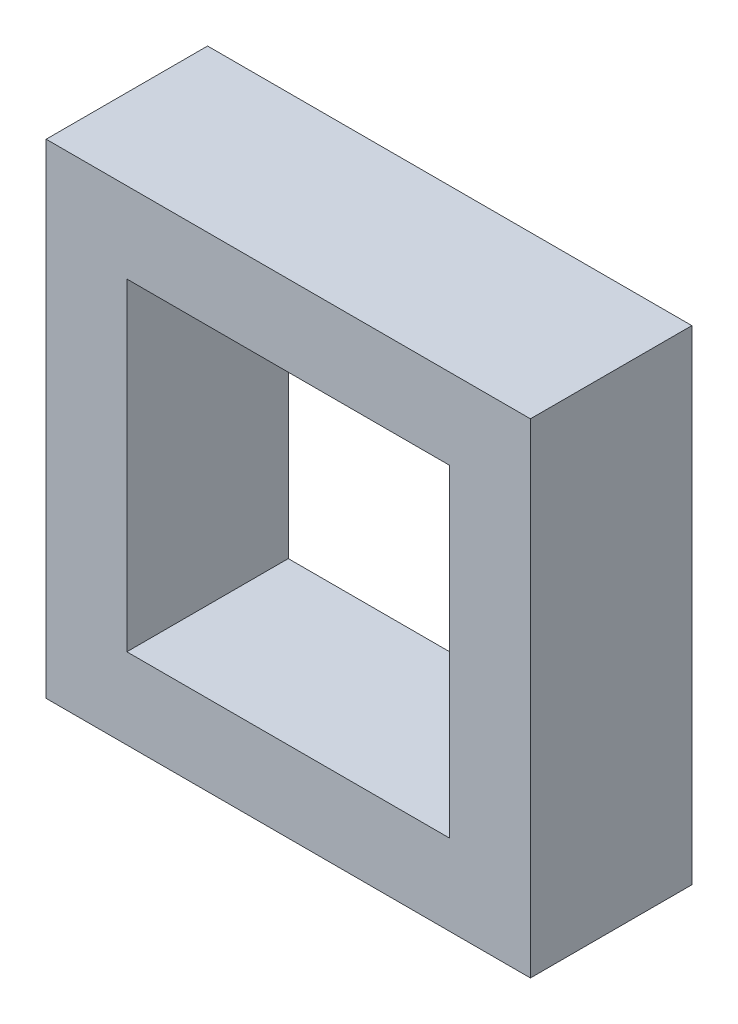
ISO-10303-21;
HEADER;
FILE_DESCRIPTION(('STEP AP214'),'2;1');
FILE_NAME('part.step','',(''),(''),'','','');
FILE_SCHEMA(('AUTOMOTIVE_DESIGN { 1 0 10303 214 1 1 1 1 }'));
ENDSEC;
DATA;
#1=APPLICATION_CONTEXT('core data for automotive mechanical design processes');
#2=APPLICATION_PROTOCOL_DEFINITION('international standard','automotive_design',2000,#1);
#3=PRODUCT_CONTEXT('',#1,'mechanical');
#4=PRODUCT('Part','Part','',(#3));
#5=PRODUCT_RELATED_PRODUCT_CATEGORY('part','',(#4));
#6=PRODUCT_DEFINITION_FORMATION('','',#4);
#7=PRODUCT_DEFINITION_CONTEXT('part definition',#1,'design');
#8=PRODUCT_DEFINITION('design','',#6,#7);
#9=PRODUCT_DEFINITION_SHAPE('','',#8);
#10=(LENGTH_UNIT() NAMED_UNIT(*) SI_UNIT(.MILLI.,.METRE.));
#11=(NAMED_UNIT(*) PLANE_ANGLE_UNIT() SI_UNIT($,.RADIAN.));
#12=(NAMED_UNIT(*) SI_UNIT($,.STERADIAN.) SOLID_ANGLE_UNIT());
#13=UNCERTAINTY_MEASURE_WITH_UNIT(LENGTH_MEASURE(1.E-05),#10,'distance_accuracy_value','');
#14=(GEOMETRIC_REPRESENTATION_CONTEXT(3) GLOBAL_UNCERTAINTY_ASSIGNED_CONTEXT((#13)) GLOBAL_UNIT_ASSIGNED_CONTEXT((#10,
#11,#12)) REPRESENTATION_CONTEXT('',''));
#15=CARTESIAN_POINT('',(0.,0.,0.));
#16=DIRECTION('',(0.,0.,1.));
#17=DIRECTION('',(1.,0.,0.));
#18=AXIS2_PLACEMENT_3D('',#15,#16,#17);
#19=CARTESIAN_POINT('',(0.,0.,2.));
#20=DIRECTION('',(0.,0.,-1.));
#21=DIRECTION('',(-1.,0.,0.));
#22=AXIS2_PLACEMENT_3D('',#19,#20,#21);
#23=PLANE('',#22);
#24=DIRECTION('',(0.,1.,0.));
#25=VECTOR('',#24,1.);
#26=CARTESIAN_POINT('',(5.,5.,2.));
#27=LINE('',#26,#25);
#28=CARTESIAN_POINT('',(5.,-1.,2.));
#29=VERTEX_POINT('',#28);
#30=CARTESIAN_POINT('',(5.,5.,2.));
#31=VERTEX_POINT('',#30);
#32=EDGE_CURVE('E136',#29,#31,#27,.T.);
#33=ORIENTED_EDGE('',*,*,#32,.T.);
#34=DIRECTION('',(-1.,0.,0.));
#35=VECTOR('',#34,1.);
#36=CARTESIAN_POINT('',(5.,5.,2.));
#37=LINE('',#36,#35);
#38=CARTESIAN_POINT('',(-1.,5.,2.));
#39=VERTEX_POINT('',#38);
#40=EDGE_CURVE('E139',#31,#39,#37,.T.);
#41=ORIENTED_EDGE('',*,*,#40,.T.);
#42=DIRECTION('',(0.,-1.,0.));
#43=VECTOR('',#42,1.);
#44=CARTESIAN_POINT('',(-1.,5.,2.));
#45=LINE('',#44,#43);
#46=CARTESIAN_POINT('',(-1.,-1.,2.));
#47=VERTEX_POINT('',#46);
#48=EDGE_CURVE('E142',#39,#47,#45,.T.);
#49=ORIENTED_EDGE('',*,*,#48,.T.);
#50=DIRECTION('',(1.,0.,0.));
#51=VECTOR('',#50,1.);
#52=CARTESIAN_POINT('',(5.,-1.,2.));
#53=LINE('',#52,#51);
#54=EDGE_CURVE('E144',#47,#29,#53,.T.);
#55=ORIENTED_EDGE('',*,*,#54,.T.);
#56=EDGE_LOOP('',(#33,#41,#49,#55));
#57=FACE_BOUND('',#56,.T.);
#58=DIRECTION('',(0.,-1.,0.));
#59=VECTOR('',#58,1.);
#60=CARTESIAN_POINT('',(0.,0.,2.));
#61=LINE('',#60,#59);
#62=CARTESIAN_POINT('',(0.,4.,2.));
#63=VERTEX_POINT('',#62);
#64=CARTESIAN_POINT('',(0.,0.,2.));
#65=VERTEX_POINT('',#64);
#66=EDGE_CURVE('E100',#63,#65,#61,.T.);
#67=ORIENTED_EDGE('',*,*,#66,.F.);
#68=DIRECTION('',(-1.,0.,0.));
#69=VECTOR('',#68,1.);
#70=CARTESIAN_POINT('',(0.,4.,2.));
#71=LINE('',#70,#69);
#72=CARTESIAN_POINT('',(4.,4.,2.));
#73=VERTEX_POINT('',#72);
#74=EDGE_CURVE('E122',#73,#63,#71,.T.);
#75=ORIENTED_EDGE('',*,*,#74,.F.);
#76=DIRECTION('',(0.,1.,0.));
#77=VECTOR('',#76,1.);
#78=CARTESIAN_POINT('',(4.,0.,2.));
#79=LINE('',#78,#77);
#80=CARTESIAN_POINT('',(4.,0.,2.));
#81=VERTEX_POINT('',#80);
#82=EDGE_CURVE('E120',#81,#73,#79,.T.);
#83=ORIENTED_EDGE('',*,*,#82,.F.);
#84=DIRECTION('',(1.,0.,0.));
#85=VECTOR('',#84,1.);
#86=CARTESIAN_POINT('',(0.,0.,2.));
#87=LINE('',#86,#85);
#88=EDGE_CURVE('E108',#65,#81,#87,.T.);
#89=ORIENTED_EDGE('',*,*,#88,.F.);
#90=EDGE_LOOP('',(#67,#75,#83,#89));
#91=FACE_BOUND('',#90,.T.);
#92=ADVANCED_FACE('F35',(#57,#91),#23,.F.);
#93=CARTESIAN_POINT('',(0.,0.,0.));
#94=DIRECTION('',(0.,0.,-1.));
#95=DIRECTION('',(-1.,0.,0.));
#96=AXIS2_PLACEMENT_3D('',#93,#94,#95);
#97=PLANE('',#96);
#98=DIRECTION('',(0.,1.,0.));
#99=VECTOR('',#98,1.);
#100=CARTESIAN_POINT('',(5.,5.,0.));
#101=LINE('',#100,#99);
#102=CARTESIAN_POINT('',(5.,-1.,0.));
#103=VERTEX_POINT('',#102);
#104=CARTESIAN_POINT('',(5.,5.,0.));
#105=VERTEX_POINT('',#104);
#106=EDGE_CURVE('E116',#103,#105,#101,.T.);
#107=ORIENTED_EDGE('',*,*,#106,.F.);
#108=DIRECTION('',(1.,0.,0.));
#109=VECTOR('',#108,1.);
#110=CARTESIAN_POINT('',(5.,-1.,0.));
#111=LINE('',#110,#109);
#112=CARTESIAN_POINT('',(-1.,-1.,0.));
#113=VERTEX_POINT('',#112);
#114=EDGE_CURVE('E140',#113,#103,#111,.T.);
#115=ORIENTED_EDGE('',*,*,#114,.F.);
#116=DIRECTION('',(0.,-1.,0.));
#117=VECTOR('',#116,1.);
#118=CARTESIAN_POINT('',(-1.,5.,0.));
#119=LINE('',#118,#117);
#120=CARTESIAN_POINT('',(-1.,5.,0.));
#121=VERTEX_POINT('',#120);
#122=EDGE_CURVE('E151',#121,#113,#119,.T.);
#123=ORIENTED_EDGE('',*,*,#122,.F.);
#124=DIRECTION('',(-1.,0.,0.));
#125=VECTOR('',#124,1.);
#126=CARTESIAN_POINT('',(5.,5.,0.));
#127=LINE('',#126,#125);
#128=EDGE_CURVE('E149',#105,#121,#127,.T.);
#129=ORIENTED_EDGE('',*,*,#128,.F.);
#130=EDGE_LOOP('',(#107,#115,#123,#129));
#131=FACE_BOUND('',#130,.T.);
#132=DIRECTION('',(-1.,0.,0.));
#133=VECTOR('',#132,1.);
#134=CARTESIAN_POINT('',(0.,4.,0.));
#135=LINE('',#134,#133);
#136=CARTESIAN_POINT('',(4.,4.,0.));
#137=VERTEX_POINT('',#136);
#138=CARTESIAN_POINT('',(0.,4.,0.));
#139=VERTEX_POINT('',#138);
#140=EDGE_CURVE('E109',#137,#139,#135,.T.);
#141=ORIENTED_EDGE('',*,*,#140,.T.);
#142=DIRECTION('',(0.,-1.,0.));
#143=VECTOR('',#142,1.);
#144=CARTESIAN_POINT('',(0.,0.,0.));
#145=LINE('',#144,#143);
#146=CARTESIAN_POINT('',(0.,0.,0.));
#147=VERTEX_POINT('',#146);
#148=EDGE_CURVE('E58',#139,#147,#145,.T.);
#149=ORIENTED_EDGE('',*,*,#148,.T.);
#150=DIRECTION('',(1.,0.,0.));
#151=VECTOR('',#150,1.);
#152=CARTESIAN_POINT('',(0.,0.,0.));
#153=LINE('',#152,#151);
#154=CARTESIAN_POINT('',(4.,0.,0.));
#155=VERTEX_POINT('',#154);
#156=EDGE_CURVE('E115',#147,#155,#153,.T.);
#157=ORIENTED_EDGE('',*,*,#156,.T.);
#158=DIRECTION('',(0.,1.,0.));
#159=VECTOR('',#158,1.);
#160=CARTESIAN_POINT('',(4.,0.,0.));
#161=LINE('',#160,#159);
#162=EDGE_CURVE('E128',#155,#137,#161,.T.);
#163=ORIENTED_EDGE('',*,*,#162,.T.);
#164=EDGE_LOOP('',(#141,#149,#157,#163));
#165=FACE_BOUND('',#164,.T.);
#166=ADVANCED_FACE('F169',(#131,#165),#97,.T.);
#167=CARTESIAN_POINT('',(5.,5.,2.));
#168=DIRECTION('',(-1.,0.,0.));
#169=DIRECTION('',(0.,-1.,0.));
#170=AXIS2_PLACEMENT_3D('',#167,#168,#169);
#171=PLANE('',#170);
#172=ORIENTED_EDGE('',*,*,#106,.T.);
#173=DIRECTION('',(0.,0.,-1.));
#174=VECTOR('',#173,1.);
#175=CARTESIAN_POINT('',(5.,5.,2.));
#176=LINE('',#175,#174);
#177=EDGE_CURVE('E11',#31,#105,#176,.T.);
#178=ORIENTED_EDGE('',*,*,#177,.F.);
#179=ORIENTED_EDGE('',*,*,#32,.F.);
#180=DIRECTION('',(0.,0.,-1.));
#181=VECTOR('',#180,1.);
#182=CARTESIAN_POINT('',(5.,-1.,2.));
#183=LINE('',#182,#181);
#184=EDGE_CURVE('E146',#29,#103,#183,.T.);
#185=ORIENTED_EDGE('',*,*,#184,.T.);
#186=EDGE_LOOP('',(#172,#178,#179,#185));
#187=FACE_BOUND('',#186,.T.);
#188=ADVANCED_FACE('F37',(#187),#171,.F.);
#189=CARTESIAN_POINT('',(5.,5.,2.));
#190=DIRECTION('',(0.,-1.,0.));
#191=DIRECTION('',(0.,0.,-1.));
#192=AXIS2_PLACEMENT_3D('',#189,#190,#191);
#193=PLANE('',#192);
#194=ORIENTED_EDGE('',*,*,#128,.T.);
#195=DIRECTION('',(0.,0.,-1.));
#196=VECTOR('',#195,1.);
#197=CARTESIAN_POINT('',(-1.,5.,2.));
#198=LINE('',#197,#196);
#199=EDGE_CURVE('E43',#39,#121,#198,.T.);
#200=ORIENTED_EDGE('',*,*,#199,.F.);
#201=ORIENTED_EDGE('',*,*,#40,.F.);
#202=ORIENTED_EDGE('',*,*,#177,.T.);
#203=EDGE_LOOP('',(#194,#200,#201,#202));
#204=FACE_BOUND('',#203,.T.);
#205=ADVANCED_FACE('F179',(#204),#193,.F.);
#206=CARTESIAN_POINT('',(-1.,5.,2.));
#207=DIRECTION('',(1.,0.,0.));
#208=DIRECTION('',(0.,1.,0.));
#209=AXIS2_PLACEMENT_3D('',#206,#207,#208);
#210=PLANE('',#209);
#211=ORIENTED_EDGE('',*,*,#122,.T.);
#212=DIRECTION('',(0.,0.,-1.));
#213=VECTOR('',#212,1.);
#214=CARTESIAN_POINT('',(-1.,-1.,2.));
#215=LINE('',#214,#213);
#216=EDGE_CURVE('E156',#47,#113,#215,.T.);
#217=ORIENTED_EDGE('',*,*,#216,.F.);
#218=ORIENTED_EDGE('',*,*,#48,.F.);
#219=ORIENTED_EDGE('',*,*,#199,.T.);
#220=EDGE_LOOP('',(#211,#217,#218,#219));
#221=FACE_BOUND('',#220,.T.);
#222=ADVANCED_FACE('F163',(#221),#210,.F.);
#223=CARTESIAN_POINT('',(5.,-1.,2.));
#224=DIRECTION('',(0.,1.,0.));
#225=DIRECTION('',(0.,0.,1.));
#226=AXIS2_PLACEMENT_3D('',#223,#224,#225);
#227=PLANE('',#226);
#228=ORIENTED_EDGE('',*,*,#114,.T.);
#229=ORIENTED_EDGE('',*,*,#184,.F.);
#230=ORIENTED_EDGE('',*,*,#54,.F.);
#231=ORIENTED_EDGE('',*,*,#216,.T.);
#232=EDGE_LOOP('',(#228,#229,#230,#231));
#233=FACE_BOUND('',#232,.T.);
#234=ADVANCED_FACE('F173',(#233),#227,.F.);
#235=CARTESIAN_POINT('',(0.,0.,2.));
#236=DIRECTION('',(1.,0.,0.));
#237=DIRECTION('',(0.,1.,0.));
#238=AXIS2_PLACEMENT_3D('',#235,#236,#237);
#239=PLANE('',#238);
#240=ORIENTED_EDGE('',*,*,#148,.F.);
#241=DIRECTION('',(0.,0.,-1.));
#242=VECTOR('',#241,1.);
#243=CARTESIAN_POINT('',(0.,4.,2.));
#244=LINE('',#243,#242);
#245=EDGE_CURVE('E104',#63,#139,#244,.T.);
#246=ORIENTED_EDGE('',*,*,#245,.F.);
#247=ORIENTED_EDGE('',*,*,#66,.T.);
#248=DIRECTION('',(0.,0.,-1.));
#249=VECTOR('',#248,1.);
#250=CARTESIAN_POINT('',(0.,0.,2.));
#251=LINE('',#250,#249);
#252=EDGE_CURVE('E103',#65,#147,#251,.T.);
#253=ORIENTED_EDGE('',*,*,#252,.T.);
#254=EDGE_LOOP('',(#240,#246,#247,#253));
#255=FACE_BOUND('',#254,.T.);
#256=ADVANCED_FACE('F102',(#255),#239,.T.);
#257=CARTESIAN_POINT('',(0.,0.,2.));
#258=DIRECTION('',(0.,1.,0.));
#259=DIRECTION('',(0.,0.,1.));
#260=AXIS2_PLACEMENT_3D('',#257,#258,#259);
#261=PLANE('',#260);
#262=ORIENTED_EDGE('',*,*,#156,.F.);
#263=ORIENTED_EDGE('',*,*,#252,.F.);
#264=ORIENTED_EDGE('',*,*,#88,.T.);
#265=DIRECTION('',(0.,0.,-1.));
#266=VECTOR('',#265,1.);
#267=CARTESIAN_POINT('',(4.,0.,2.));
#268=LINE('',#267,#266);
#269=EDGE_CURVE('E117',#81,#155,#268,.T.);
#270=ORIENTED_EDGE('',*,*,#269,.T.);
#271=EDGE_LOOP('',(#262,#263,#264,#270));
#272=FACE_BOUND('',#271,.T.);
#273=ADVANCED_FACE('F112',(#272),#261,.T.);
#274=CARTESIAN_POINT('',(4.,0.,2.));
#275=DIRECTION('',(-1.,0.,0.));
#276=DIRECTION('',(0.,-1.,0.));
#277=AXIS2_PLACEMENT_3D('',#274,#275,#276);
#278=PLANE('',#277);
#279=ORIENTED_EDGE('',*,*,#162,.F.);
#280=ORIENTED_EDGE('',*,*,#269,.F.);
#281=ORIENTED_EDGE('',*,*,#82,.T.);
#282=DIRECTION('',(0.,0.,-1.));
#283=VECTOR('',#282,1.);
#284=CARTESIAN_POINT('',(4.,4.,2.));
#285=LINE('',#284,#283);
#286=EDGE_CURVE('E50',#73,#137,#285,.T.);
#287=ORIENTED_EDGE('',*,*,#286,.T.);
#288=EDGE_LOOP('',(#279,#280,#281,#287));
#289=FACE_BOUND('',#288,.T.);
#290=ADVANCED_FACE('F202',(#289),#278,.T.);
#291=CARTESIAN_POINT('',(0.,4.,2.));
#292=DIRECTION('',(0.,-1.,0.));
#293=DIRECTION('',(0.,0.,-1.));
#294=AXIS2_PLACEMENT_3D('',#291,#292,#293);
#295=PLANE('',#294);
#296=ORIENTED_EDGE('',*,*,#140,.F.);
#297=ORIENTED_EDGE('',*,*,#286,.F.);
#298=ORIENTED_EDGE('',*,*,#74,.T.);
#299=ORIENTED_EDGE('',*,*,#245,.T.);
#300=EDGE_LOOP('',(#296,#297,#298,#299));
#301=FACE_BOUND('',#300,.T.);
#302=ADVANCED_FACE('F206',(#301),#295,.T.);
#303=CLOSED_SHELL('',(#92,#166,#188,#205,#222,#234,#256,#273,#290,#302));
#304=MANIFOLD_SOLID_BREP('B2',#303);
#305=ADVANCED_BREP_SHAPE_REPRESENTATION('',(#18,#304),#14);
#306=SHAPE_DEFINITION_REPRESENTATION(#9,#305);
ENDSEC;
END-ISO-10303-21;
